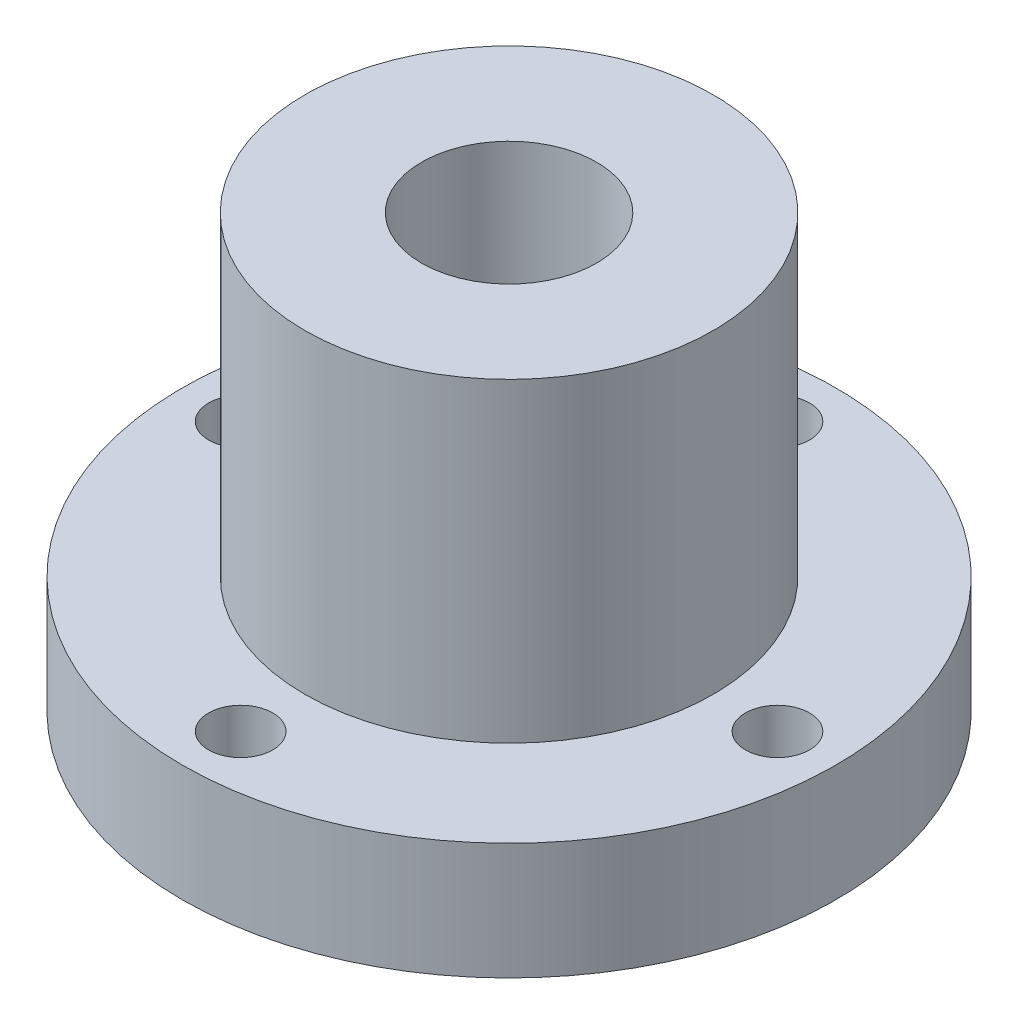
ISO-10303-21;
HEADER;
FILE_DESCRIPTION(('STEP AP214'),'2;1');
FILE_NAME('part.step','',(''),(''),'','','');
FILE_SCHEMA(('AUTOMOTIVE_DESIGN { 1 0 10303 214 1 1 1 1 }'));
ENDSEC;
DATA;
#1=APPLICATION_CONTEXT('core data for automotive mechanical design processes');
#2=APPLICATION_PROTOCOL_DEFINITION('international standard','automotive_design',2000,#1);
#3=PRODUCT_CONTEXT('',#1,'mechanical');
#4=PRODUCT('Part','Part','',(#3));
#5=PRODUCT_RELATED_PRODUCT_CATEGORY('part','',(#4));
#6=PRODUCT_DEFINITION_FORMATION('','',#4);
#7=PRODUCT_DEFINITION_CONTEXT('part definition',#1,'design');
#8=PRODUCT_DEFINITION('design','',#6,#7);
#9=PRODUCT_DEFINITION_SHAPE('','',#8);
#10=(LENGTH_UNIT() NAMED_UNIT(*) SI_UNIT(.MILLI.,.METRE.));
#11=(NAMED_UNIT(*) PLANE_ANGLE_UNIT() SI_UNIT($,.RADIAN.));
#12=(NAMED_UNIT(*) SI_UNIT($,.STERADIAN.) SOLID_ANGLE_UNIT());
#13=UNCERTAINTY_MEASURE_WITH_UNIT(LENGTH_MEASURE(1.E-05),#10,'distance_accuracy_value','');
#14=(GEOMETRIC_REPRESENTATION_CONTEXT(3) GLOBAL_UNCERTAINTY_ASSIGNED_CONTEXT((#13)) GLOBAL_UNIT_ASSIGNED_CONTEXT((#10,
#11,#12)) REPRESENTATION_CONTEXT('',''));
#15=CARTESIAN_POINT('',(0.,0.,0.));
#16=DIRECTION('',(0.,0.,1.));
#17=DIRECTION('',(1.,0.,0.));
#18=AXIS2_PLACEMENT_3D('',#15,#16,#17);
#19=CARTESIAN_POINT('',(0.,10.,0.));
#20=DIRECTION('',(0.,1.,0.));
#21=DIRECTION('',(0.,0.,1.));
#22=AXIS2_PLACEMENT_3D('',#19,#20,#21);
#23=PLANE('',#22);
#24=CARTESIAN_POINT('',(0.,10.,-23.));
#25=DIRECTION('',(0.,1.,0.));
#26=DIRECTION('',(0.,0.,1.));
#27=AXIS2_PLACEMENT_3D('',#24,#25,#26);
#28=CIRCLE('',#27,2.75);
#29=CARTESIAN_POINT('',(0.,10.,-20.25));
#30=VERTEX_POINT('',#29);
#31=EDGE_CURVE('E62',#30,#30,#28,.T.);
#32=ORIENTED_EDGE('',*,*,#31,.F.);
#33=EDGE_LOOP('',(#32));
#34=FACE_BOUND('',#33,.T.);
#35=CARTESIAN_POINT('',(23.0000000000007,10.,-6.49474285442234E-13));
#36=DIRECTION('',(0.,1.,0.));
#37=DIRECTION('',(0.,0.,1.));
#38=AXIS2_PLACEMENT_3D('',#35,#36,#37);
#39=CIRCLE('',#38,2.75000000000051);
#40=CARTESIAN_POINT('',(23.0000000000007,10.,2.74999999999986));
#41=VERTEX_POINT('',#40);
#42=EDGE_CURVE('E122',#41,#41,#39,.T.);
#43=ORIENTED_EDGE('',*,*,#42,.F.);
#44=EDGE_LOOP('',(#43));
#45=FACE_BOUND('',#44,.T.);
#46=CARTESIAN_POINT('',(1.29894857088447E-12,10.,23.));
#47=DIRECTION('',(0.,1.,0.));
#48=DIRECTION('',(0.,0.,1.));
#49=AXIS2_PLACEMENT_3D('',#46,#47,#48);
#50=CIRCLE('',#49,2.7500000000014);
#51=CARTESIAN_POINT('',(1.29894857088447E-12,10.,25.7500000000014));
#52=VERTEX_POINT('',#51);
#53=EDGE_CURVE('E126',#52,#52,#50,.T.);
#54=ORIENTED_EDGE('',*,*,#53,.F.);
#55=EDGE_LOOP('',(#54));
#56=FACE_BOUND('',#55,.T.);
#57=CARTESIAN_POINT('',(-22.9999999999993,10.,6.52290973080273E-13));
#58=DIRECTION('',(0.,1.,0.));
#59=DIRECTION('',(0.,0.,1.));
#60=AXIS2_PLACEMENT_3D('',#57,#58,#59);
#61=CIRCLE('',#60,2.75000000000104);
#62=CARTESIAN_POINT('',(-22.9999999999993,10.,2.75000000000169));
#63=VERTEX_POINT('',#62);
#64=EDGE_CURVE('E86',#63,#63,#61,.T.);
#65=ORIENTED_EDGE('',*,*,#64,.F.);
#66=EDGE_LOOP('',(#65));
#67=FACE_BOUND('',#66,.T.);
#68=CARTESIAN_POINT('',(0.,10.,0.));
#69=DIRECTION('',(0.,1.,0.));
#70=DIRECTION('',(0.,0.,1.));
#71=AXIS2_PLACEMENT_3D('',#68,#69,#70);
#72=CIRCLE('',#71,28.);
#73=CARTESIAN_POINT('',(0.,10.,28.));
#74=VERTEX_POINT('',#73);
#75=EDGE_CURVE('E10',#74,#74,#72,.T.);
#76=ORIENTED_EDGE('',*,*,#75,.T.);
#77=EDGE_LOOP('',(#76));
#78=FACE_BOUND('',#77,.T.);
#79=CARTESIAN_POINT('',(0.,10.,0.));
#80=DIRECTION('',(0.,1.,0.));
#81=DIRECTION('',(0.,0.,1.));
#82=AXIS2_PLACEMENT_3D('',#79,#80,#81);
#83=CIRCLE('',#82,17.5);
#84=CARTESIAN_POINT('',(0.,10.,17.5));
#85=VERTEX_POINT('',#84);
#86=EDGE_CURVE('E77',#85,#85,#83,.T.);
#87=ORIENTED_EDGE('',*,*,#86,.F.);
#88=EDGE_LOOP('',(#87));
#89=FACE_BOUND('',#88,.T.);
#90=ADVANCED_FACE('F37',(#34,#45,#56,#67,#78,#89),#23,.T.);
#91=CARTESIAN_POINT('',(0.,0.,0.));
#92=DIRECTION('',(0.,1.,0.));
#93=DIRECTION('',(0.,0.,1.));
#94=AXIS2_PLACEMENT_3D('',#91,#92,#93);
#95=PLANE('',#94);
#96=CARTESIAN_POINT('',(0.,0.,-23.));
#97=DIRECTION('',(0.,1.,0.));
#98=DIRECTION('',(0.,0.,1.));
#99=AXIS2_PLACEMENT_3D('',#96,#97,#98);
#100=CIRCLE('',#99,2.75);
#101=CARTESIAN_POINT('',(0.,0.,-20.25));
#102=VERTEX_POINT('',#101);
#103=EDGE_CURVE('E41',#102,#102,#100,.T.);
#104=ORIENTED_EDGE('',*,*,#103,.T.);
#105=EDGE_LOOP('',(#104));
#106=FACE_BOUND('',#105,.T.);
#107=CARTESIAN_POINT('',(23.0000000000007,0.,-6.49474285442234E-13));
#108=DIRECTION('',(0.,1.,0.));
#109=DIRECTION('',(0.,0.,1.));
#110=AXIS2_PLACEMENT_3D('',#107,#108,#109);
#111=CIRCLE('',#110,2.75000000000051);
#112=CARTESIAN_POINT('',(23.0000000000007,0.,2.74999999999986));
#113=VERTEX_POINT('',#112);
#114=EDGE_CURVE('E65',#113,#113,#111,.T.);
#115=ORIENTED_EDGE('',*,*,#114,.T.);
#116=EDGE_LOOP('',(#115));
#117=FACE_BOUND('',#116,.T.);
#118=CARTESIAN_POINT('',(1.29894857088447E-12,0.,23.));
#119=DIRECTION('',(0.,1.,0.));
#120=DIRECTION('',(0.,0.,1.));
#121=AXIS2_PLACEMENT_3D('',#118,#119,#120);
#122=CIRCLE('',#121,2.7500000000014);
#123=CARTESIAN_POINT('',(1.29894857088447E-12,0.,25.7500000000014));
#124=VERTEX_POINT('',#123);
#125=EDGE_CURVE('E61',#124,#124,#122,.T.);
#126=ORIENTED_EDGE('',*,*,#125,.T.);
#127=EDGE_LOOP('',(#126));
#128=FACE_BOUND('',#127,.T.);
#129=CARTESIAN_POINT('',(-22.9999999999993,0.,6.52290973080273E-13));
#130=DIRECTION('',(0.,1.,0.));
#131=DIRECTION('',(0.,0.,1.));
#132=AXIS2_PLACEMENT_3D('',#129,#130,#131);
#133=CIRCLE('',#132,2.75000000000104);
#134=CARTESIAN_POINT('',(-22.9999999999993,0.,2.75000000000169));
#135=VERTEX_POINT('',#134);
#136=EDGE_CURVE('E57',#135,#135,#133,.T.);
#137=ORIENTED_EDGE('',*,*,#136,.T.);
#138=EDGE_LOOP('',(#137));
#139=FACE_BOUND('',#138,.T.);
#140=CARTESIAN_POINT('',(0.,0.,0.));
#141=DIRECTION('',(0.,1.,0.));
#142=DIRECTION('',(0.,0.,1.));
#143=AXIS2_PLACEMENT_3D('',#140,#141,#142);
#144=CIRCLE('',#143,28.);
#145=CARTESIAN_POINT('',(0.,0.,28.));
#146=VERTEX_POINT('',#145);
#147=EDGE_CURVE('E46',#146,#146,#144,.T.);
#148=ORIENTED_EDGE('',*,*,#147,.F.);
#149=EDGE_LOOP('',(#148));
#150=FACE_BOUND('',#149,.T.);
#151=CARTESIAN_POINT('',(0.,0.,0.));
#152=DIRECTION('',(0.,1.,0.));
#153=DIRECTION('',(0.,0.,1.));
#154=AXIS2_PLACEMENT_3D('',#151,#152,#153);
#155=CIRCLE('',#154,7.5);
#156=CARTESIAN_POINT('',(0.,0.,7.5));
#157=VERTEX_POINT('',#156);
#158=EDGE_CURVE('E52',#157,#157,#155,.T.);
#159=ORIENTED_EDGE('',*,*,#158,.T.);
#160=EDGE_LOOP('',(#159));
#161=FACE_BOUND('',#160,.T.);
#162=ADVANCED_FACE('F96',(#106,#117,#128,#139,#150,#161),#95,.F.);
#163=CARTESIAN_POINT('',(0.,10.,0.));
#164=DIRECTION('',(0.,-1.,0.));
#165=DIRECTION('',(0.,0.,-1.));
#166=AXIS2_PLACEMENT_3D('',#163,#164,#165);
#167=CYLINDRICAL_SURFACE('',#166,28.);
#168=ORIENTED_EDGE('',*,*,#75,.F.);
#169=EDGE_LOOP('',(#168));
#170=FACE_BOUND('',#169,.T.);
#171=ORIENTED_EDGE('',*,*,#147,.T.);
#172=EDGE_LOOP('',(#171));
#173=FACE_BOUND('',#172,.T.);
#174=ADVANCED_FACE('F39',(#170,#173),#167,.T.);
#175=CARTESIAN_POINT('',(0.,10.,0.));
#176=DIRECTION('',(0.,-1.,0.));
#177=DIRECTION('',(0.,0.,-1.));
#178=AXIS2_PLACEMENT_3D('',#175,#176,#177);
#179=CYLINDRICAL_SURFACE('',#178,7.5);
#180=ORIENTED_EDGE('',*,*,#158,.F.);
#181=EDGE_LOOP('',(#180));
#182=FACE_BOUND('',#181,.T.);
#183=CARTESIAN_POINT('',(0.,37.,0.));
#184=DIRECTION('',(0.,1.,0.));
#185=DIRECTION('',(0.,0.,1.));
#186=AXIS2_PLACEMENT_3D('',#183,#184,#185);
#187=CIRCLE('',#186,7.5);
#188=CARTESIAN_POINT('',(0.,37.,7.5));
#189=VERTEX_POINT('',#188);
#190=EDGE_CURVE('E72',#189,#189,#187,.T.);
#191=ORIENTED_EDGE('',*,*,#190,.T.);
#192=EDGE_LOOP('',(#191));
#193=FACE_BOUND('',#192,.T.);
#194=ADVANCED_FACE('F98',(#182,#193),#179,.F.);
#195=CARTESIAN_POINT('',(0.,37.,0.));
#196=DIRECTION('',(0.,1.,0.));
#197=DIRECTION('',(0.,0.,1.));
#198=AXIS2_PLACEMENT_3D('',#195,#196,#197);
#199=PLANE('',#198);
#200=CARTESIAN_POINT('',(0.,37.,0.));
#201=DIRECTION('',(0.,1.,0.));
#202=DIRECTION('',(0.,0.,1.));
#203=AXIS2_PLACEMENT_3D('',#200,#201,#202);
#204=CIRCLE('',#203,17.5);
#205=CARTESIAN_POINT('',(0.,37.,17.5));
#206=VERTEX_POINT('',#205);
#207=EDGE_CURVE('E83',#206,#206,#204,.T.);
#208=ORIENTED_EDGE('',*,*,#207,.T.);
#209=EDGE_LOOP('',(#208));
#210=FACE_BOUND('',#209,.T.);
#211=ORIENTED_EDGE('',*,*,#190,.F.);
#212=EDGE_LOOP('',(#211));
#213=FACE_BOUND('',#212,.T.);
#214=ADVANCED_FACE('F100',(#210,#213),#199,.T.);
#215=CARTESIAN_POINT('',(0.,37.,0.));
#216=DIRECTION('',(0.,-1.,0.));
#217=DIRECTION('',(0.,0.,-1.));
#218=AXIS2_PLACEMENT_3D('',#215,#216,#217);
#219=CYLINDRICAL_SURFACE('',#218,17.5);
#220=ORIENTED_EDGE('',*,*,#207,.F.);
#221=EDGE_LOOP('',(#220));
#222=FACE_BOUND('',#221,.T.);
#223=ORIENTED_EDGE('',*,*,#86,.T.);
#224=EDGE_LOOP('',(#223));
#225=FACE_BOUND('',#224,.T.);
#226=ADVANCED_FACE('F106',(#222,#225),#219,.T.);
#227=CARTESIAN_POINT('',(-22.9999999999993,-17.,6.52290973080273E-13));
#228=DIRECTION('',(0.,1.,0.));
#229=DIRECTION('',(0.,0.,1.));
#230=AXIS2_PLACEMENT_3D('',#227,#228,#229);
#231=CYLINDRICAL_SURFACE('',#230,2.75000000000104);
#232=ORIENTED_EDGE('',*,*,#64,.T.);
#233=EDGE_LOOP('',(#232));
#234=FACE_BOUND('',#233,.T.);
#235=ORIENTED_EDGE('',*,*,#136,.F.);
#236=EDGE_LOOP('',(#235));
#237=FACE_BOUND('',#236,.T.);
#238=ADVANCED_FACE('F133',(#234,#237),#231,.F.);
#239=CARTESIAN_POINT('',(1.29894857088447E-12,-17.,23.));
#240=DIRECTION('',(0.,1.,0.));
#241=DIRECTION('',(0.,0.,1.));
#242=AXIS2_PLACEMENT_3D('',#239,#240,#241);
#243=CYLINDRICAL_SURFACE('',#242,2.7500000000014);
#244=ORIENTED_EDGE('',*,*,#53,.T.);
#245=EDGE_LOOP('',(#244));
#246=FACE_BOUND('',#245,.T.);
#247=ORIENTED_EDGE('',*,*,#125,.F.);
#248=EDGE_LOOP('',(#247));
#249=FACE_BOUND('',#248,.T.);
#250=ADVANCED_FACE('F138',(#246,#249),#243,.F.);
#251=CARTESIAN_POINT('',(23.0000000000007,-17.,-6.49474285442234E-13));
#252=DIRECTION('',(0.,1.,0.));
#253=DIRECTION('',(0.,0.,1.));
#254=AXIS2_PLACEMENT_3D('',#251,#252,#253);
#255=CYLINDRICAL_SURFACE('',#254,2.75000000000051);
#256=ORIENTED_EDGE('',*,*,#42,.T.);
#257=EDGE_LOOP('',(#256));
#258=FACE_BOUND('',#257,.T.);
#259=ORIENTED_EDGE('',*,*,#114,.F.);
#260=EDGE_LOOP('',(#259));
#261=FACE_BOUND('',#260,.T.);
#262=ADVANCED_FACE('F144',(#258,#261),#255,.F.);
#263=CARTESIAN_POINT('',(0.,-17.,-23.));
#264=DIRECTION('',(0.,1.,0.));
#265=DIRECTION('',(0.,0.,1.));
#266=AXIS2_PLACEMENT_3D('',#263,#264,#265);
#267=CYLINDRICAL_SURFACE('',#266,2.75);
#268=ORIENTED_EDGE('',*,*,#31,.T.);
#269=EDGE_LOOP('',(#268));
#270=FACE_BOUND('',#269,.T.);
#271=ORIENTED_EDGE('',*,*,#103,.F.);
#272=EDGE_LOOP('',(#271));
#273=FACE_BOUND('',#272,.T.);
#274=ADVANCED_FACE('F148',(#270,#273),#267,.F.);
#275=CLOSED_SHELL('',(#90,#162,#174,#194,#214,#226,#238,#250,#262,#274));
#276=MANIFOLD_SOLID_BREP('B2',#275);
#277=ADVANCED_BREP_SHAPE_REPRESENTATION('',(#18,#276),#14);
#278=SHAPE_DEFINITION_REPRESENTATION(#9,#277);
ENDSEC;
END-ISO-10303-21;
